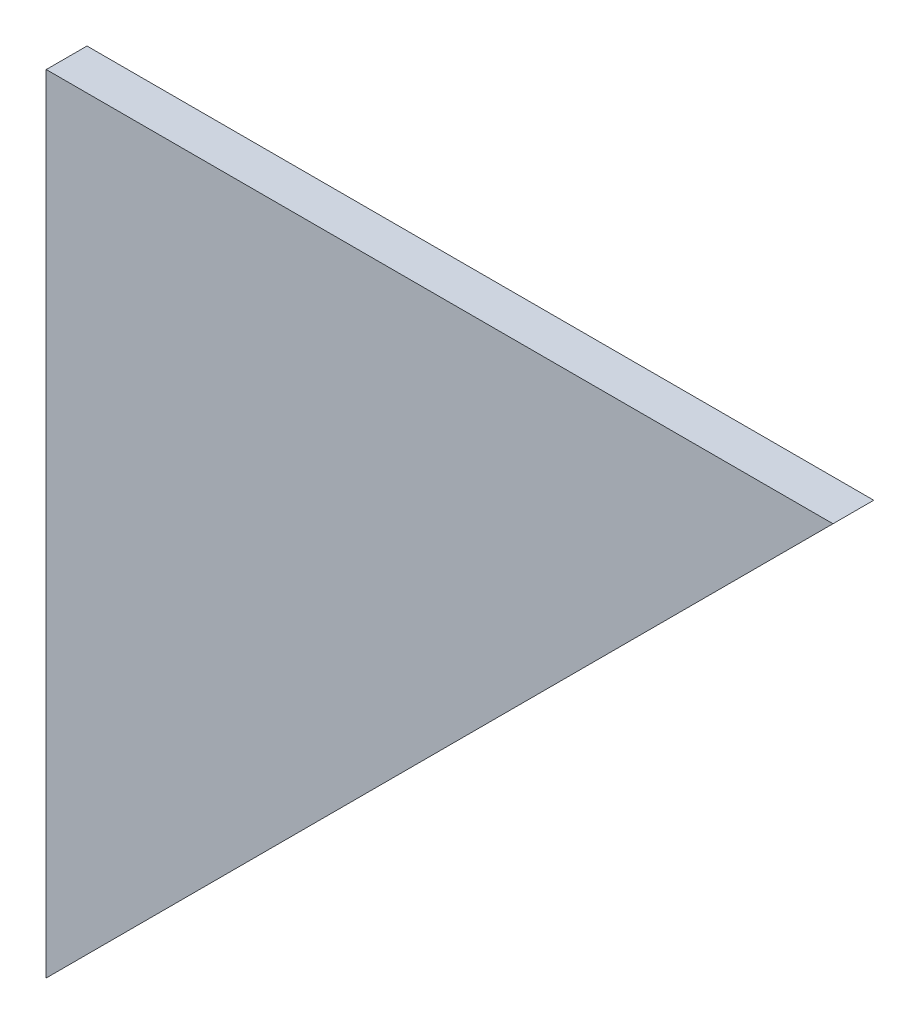
ISO-10303-21;
HEADER;
FILE_DESCRIPTION(('STEP AP214'),'2;1');
FILE_NAME('part.step','',(''),(''),'','','');
FILE_SCHEMA(('AUTOMOTIVE_DESIGN { 1 0 10303 214 1 1 1 1 }'));
ENDSEC;
DATA;
#1=APPLICATION_CONTEXT('core data for automotive mechanical design processes');
#2=APPLICATION_PROTOCOL_DEFINITION('international standard','automotive_design',2000,#1);
#3=PRODUCT_CONTEXT('',#1,'mechanical');
#4=PRODUCT('Part','Part','',(#3));
#5=PRODUCT_RELATED_PRODUCT_CATEGORY('part','',(#4));
#6=PRODUCT_DEFINITION_FORMATION('','',#4);
#7=PRODUCT_DEFINITION_CONTEXT('part definition',#1,'design');
#8=PRODUCT_DEFINITION('design','',#6,#7);
#9=PRODUCT_DEFINITION_SHAPE('','',#8);
#10=(LENGTH_UNIT() NAMED_UNIT(*) SI_UNIT(.MILLI.,.METRE.));
#11=(NAMED_UNIT(*) PLANE_ANGLE_UNIT() SI_UNIT($,.RADIAN.));
#12=(NAMED_UNIT(*) SI_UNIT($,.STERADIAN.) SOLID_ANGLE_UNIT());
#13=UNCERTAINTY_MEASURE_WITH_UNIT(LENGTH_MEASURE(1.E-05),#10,'distance_accuracy_value','');
#14=(GEOMETRIC_REPRESENTATION_CONTEXT(3) GLOBAL_UNCERTAINTY_ASSIGNED_CONTEXT((#13)) GLOBAL_UNIT_ASSIGNED_CONTEXT((#10,
#11,#12)) REPRESENTATION_CONTEXT('',''));
#15=CARTESIAN_POINT('',(0.,0.,0.));
#16=DIRECTION('',(0.,0.,1.));
#17=DIRECTION('',(1.,0.,0.));
#18=AXIS2_PLACEMENT_3D('',#15,#16,#17);
#19=CARTESIAN_POINT('',(49.6381025755781,-49.638102575578,115.204878));
#20=DIRECTION('',(1.,0.,0.));
#21=DIRECTION('',(0.,0.,-1.));
#22=AXIS2_PLACEMENT_3D('',#19,#20,#21);
#23=PLANE('',#22);
#24=DIRECTION('',(0.,-1.,0.));
#25=VECTOR('',#24,1.);
#26=CARTESIAN_POINT('',(49.6381025755781,-49.638102575578,112.204878));
#27=LINE('',#26,#25);
#28=CARTESIAN_POINT('',(49.6381025755781,-49.638102575578,112.204878));
#29=VERTEX_POINT('',#28);
#30=CARTESIAN_POINT('',(49.6381025755781,-107.572775551572,112.204878));
#31=VERTEX_POINT('',#30);
#32=EDGE_CURVE('E80',#29,#31,#27,.T.);
#33=ORIENTED_EDGE('',*,*,#32,.T.);
#34=DIRECTION('',(0.,0.,-1.));
#35=VECTOR('',#34,1.);
#36=CARTESIAN_POINT('',(49.6381025755781,-107.572775551572,115.204878));
#37=LINE('',#36,#35);
#38=CARTESIAN_POINT('',(49.6381025755781,-107.572775551572,115.204878));
#39=VERTEX_POINT('',#38);
#40=EDGE_CURVE('E11',#39,#31,#37,.T.);
#41=ORIENTED_EDGE('',*,*,#40,.F.);
#42=DIRECTION('',(0.,-1.,0.));
#43=VECTOR('',#42,1.);
#44=CARTESIAN_POINT('',(49.6381025755781,-49.638102575578,115.204878));
#45=LINE('',#44,#43);
#46=CARTESIAN_POINT('',(49.6381025755781,-49.638102575578,115.204878));
#47=VERTEX_POINT('',#46);
#48=EDGE_CURVE('E73',#47,#39,#45,.T.);
#49=ORIENTED_EDGE('',*,*,#48,.F.);
#50=DIRECTION('',(0.,0.,-1.));
#51=VECTOR('',#50,1.);
#52=CARTESIAN_POINT('',(49.6381025755781,-49.638102575578,115.204878));
#53=LINE('',#52,#51);
#54=EDGE_CURVE('E81',#47,#29,#53,.T.);
#55=ORIENTED_EDGE('',*,*,#54,.T.);
#56=EDGE_LOOP('',(#33,#41,#49,#55));
#57=FACE_BOUND('',#56,.T.);
#58=ADVANCED_FACE('F33',(#57),#23,.F.);
#59=CARTESIAN_POINT('',(49.6381025755781,-107.572775551572,115.204878));
#60=DIRECTION('',(-0.707106781186548,0.707106781186547,0.));
#61=DIRECTION('',(-0.707106781186547,-0.707106781186548,0.));
#62=AXIS2_PLACEMENT_3D('',#59,#60,#61);
#63=PLANE('',#62);
#64=DIRECTION('',(0.707106781186547,0.707106781186548,0.));
#65=VECTOR('',#64,1.);
#66=CARTESIAN_POINT('',(49.6381025755781,-107.572775551572,112.204878));
#67=LINE('',#66,#65);
#68=CARTESIAN_POINT('',(107.572775551572,-49.638102575578,112.204878));
#69=VERTEX_POINT('',#68);
#70=EDGE_CURVE('E61',#31,#69,#67,.T.);
#71=ORIENTED_EDGE('',*,*,#70,.T.);
#72=DIRECTION('',(0.,0.,-1.));
#73=VECTOR('',#72,1.);
#74=CARTESIAN_POINT('',(107.572775551572,-49.638102575578,115.204878));
#75=LINE('',#74,#73);
#76=CARTESIAN_POINT('',(107.572775551572,-49.638102575578,115.204878));
#77=VERTEX_POINT('',#76);
#78=EDGE_CURVE('E41',#77,#69,#75,.T.);
#79=ORIENTED_EDGE('',*,*,#78,.F.);
#80=DIRECTION('',(0.707106781186547,0.707106781186548,0.));
#81=VECTOR('',#80,1.);
#82=CARTESIAN_POINT('',(49.6381025755781,-107.572775551572,115.204878));
#83=LINE('',#82,#81);
#84=EDGE_CURVE('E69',#39,#77,#83,.T.);
#85=ORIENTED_EDGE('',*,*,#84,.F.);
#86=ORIENTED_EDGE('',*,*,#40,.T.);
#87=EDGE_LOOP('',(#71,#79,#85,#86));
#88=FACE_BOUND('',#87,.T.);
#89=ADVANCED_FACE('F70',(#88),#63,.F.);
#90=CARTESIAN_POINT('',(107.572775551572,-49.638102575578,115.204878));
#91=DIRECTION('',(0.,-1.,0.));
#92=DIRECTION('',(0.,0.,-1.));
#93=AXIS2_PLACEMENT_3D('',#90,#91,#92);
#94=PLANE('',#93);
#95=DIRECTION('',(-1.,0.,0.));
#96=VECTOR('',#95,1.);
#97=CARTESIAN_POINT('',(107.572775551572,-49.638102575578,112.204878));
#98=LINE('',#97,#96);
#99=EDGE_CURVE('E66',#69,#29,#98,.T.);
#100=ORIENTED_EDGE('',*,*,#99,.T.);
#101=ORIENTED_EDGE('',*,*,#54,.F.);
#102=DIRECTION('',(-1.,0.,0.));
#103=VECTOR('',#102,1.);
#104=CARTESIAN_POINT('',(107.572775551572,-49.638102575578,115.204878));
#105=LINE('',#104,#103);
#106=EDGE_CURVE('E49',#77,#47,#105,.T.);
#107=ORIENTED_EDGE('',*,*,#106,.F.);
#108=ORIENTED_EDGE('',*,*,#78,.T.);
#109=EDGE_LOOP('',(#100,#101,#107,#108));
#110=FACE_BOUND('',#109,.T.);
#111=ADVANCED_FACE('F88',(#110),#94,.F.);
#112=CARTESIAN_POINT('',(0.,0.,115.204878));
#113=DIRECTION('',(0.,0.,-1.));
#114=DIRECTION('',(-1.,0.,0.));
#115=AXIS2_PLACEMENT_3D('',#112,#113,#114);
#116=PLANE('',#115);
#117=ORIENTED_EDGE('',*,*,#48,.T.);
#118=ORIENTED_EDGE('',*,*,#84,.T.);
#119=ORIENTED_EDGE('',*,*,#106,.T.);
#120=EDGE_LOOP('',(#117,#118,#119));
#121=FACE_BOUND('',#120,.T.);
#122=ADVANCED_FACE('F76',(#121),#116,.F.);
#123=CARTESIAN_POINT('',(0.,0.,112.204878));
#124=DIRECTION('',(0.,0.,-1.));
#125=DIRECTION('',(-1.,0.,0.));
#126=AXIS2_PLACEMENT_3D('',#123,#124,#125);
#127=PLANE('',#126);
#128=ORIENTED_EDGE('',*,*,#32,.F.);
#129=ORIENTED_EDGE('',*,*,#99,.F.);
#130=ORIENTED_EDGE('',*,*,#70,.F.);
#131=EDGE_LOOP('',(#128,#129,#130));
#132=FACE_BOUND('',#131,.T.);
#133=ADVANCED_FACE('F89',(#132),#127,.T.);
#134=CLOSED_SHELL('',(#58,#89,#111,#122,#133));
#135=MANIFOLD_SOLID_BREP('B2',#134);
#136=ADVANCED_BREP_SHAPE_REPRESENTATION('',(#18,#135),#14);
#137=SHAPE_DEFINITION_REPRESENTATION(#9,#136);
ENDSEC;
END-ISO-10303-21;
